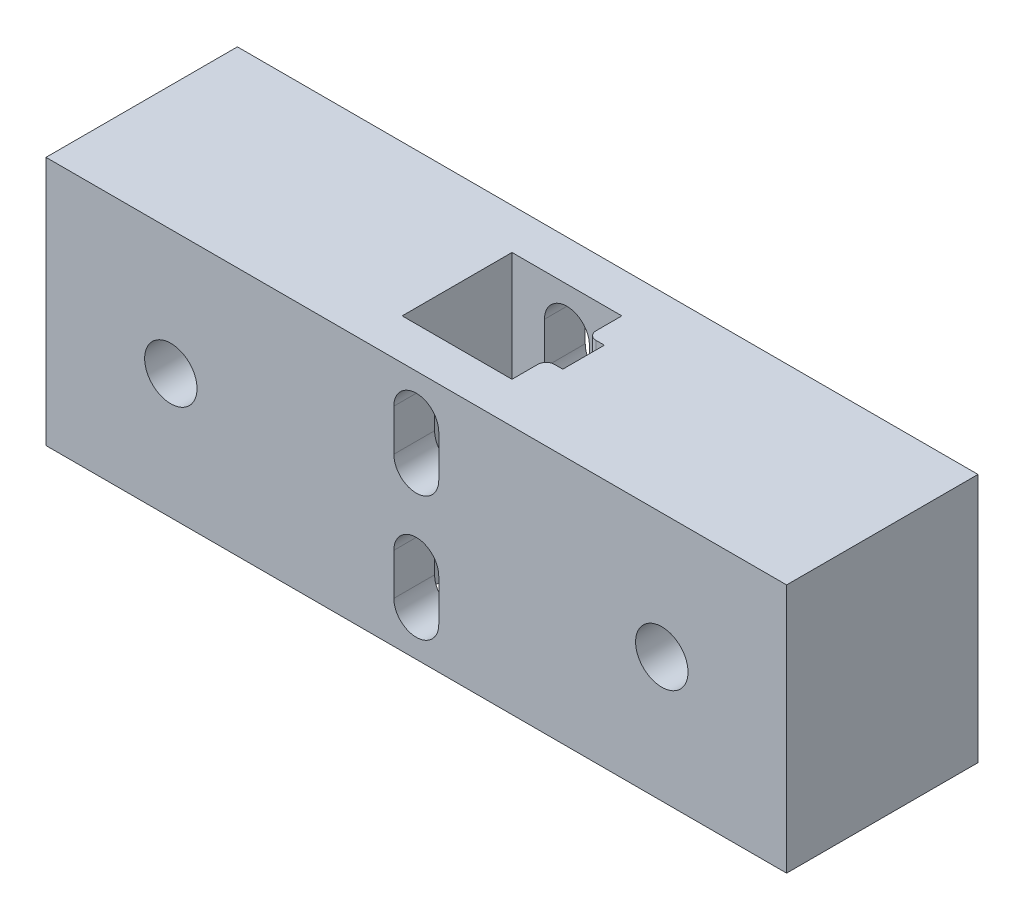
ISO-10303-21;
HEADER;
FILE_DESCRIPTION(('STEP AP214'),'2;1');
FILE_NAME('part.step','',(''),(''),'','','');
FILE_SCHEMA(('AUTOMOTIVE_DESIGN { 1 0 10303 214 1 1 1 1 }'));
ENDSEC;
DATA;
#1=APPLICATION_CONTEXT('core data for automotive mechanical design processes');
#2=APPLICATION_PROTOCOL_DEFINITION('international standard','automotive_design',2000,#1);
#3=PRODUCT_CONTEXT('',#1,'mechanical');
#4=PRODUCT('Part','Part','',(#3));
#5=PRODUCT_RELATED_PRODUCT_CATEGORY('part','',(#4));
#6=PRODUCT_DEFINITION_FORMATION('','',#4);
#7=PRODUCT_DEFINITION_CONTEXT('part definition',#1,'design');
#8=PRODUCT_DEFINITION('design','',#6,#7);
#9=PRODUCT_DEFINITION_SHAPE('','',#8);
#10=(LENGTH_UNIT() NAMED_UNIT(*) SI_UNIT(.MILLI.,.METRE.));
#11=(NAMED_UNIT(*) PLANE_ANGLE_UNIT() SI_UNIT($,.RADIAN.));
#12=(NAMED_UNIT(*) SI_UNIT($,.STERADIAN.) SOLID_ANGLE_UNIT());
#13=UNCERTAINTY_MEASURE_WITH_UNIT(LENGTH_MEASURE(1.E-05),#10,'distance_accuracy_value','');
#14=(GEOMETRIC_REPRESENTATION_CONTEXT(3) GLOBAL_UNCERTAINTY_ASSIGNED_CONTEXT((#13)) GLOBAL_UNIT_ASSIGNED_CONTEXT((#10,
#11,#12)) REPRESENTATION_CONTEXT('',''));
#15=CARTESIAN_POINT('',(0.,0.,0.));
#16=DIRECTION('',(0.,0.,1.));
#17=DIRECTION('',(1.,0.,0.));
#18=AXIS2_PLACEMENT_3D('',#15,#16,#17);
#19=CARTESIAN_POINT('',(0.,0.,23.));
#20=DIRECTION('',(0.,0.,1.));
#21=DIRECTION('',(1.,0.,0.));
#22=AXIS2_PLACEMENT_3D('',#19,#20,#21);
#23=PLANE('',#22);
#24=CARTESIAN_POINT('',(40.389968792194,-23.0911366711773,23.));
#25=DIRECTION('',(0.,0.,-1.));
#26=DIRECTION('',(-1.,0.,0.));
#27=AXIS2_PLACEMENT_3D('',#24,#25,#26);
#28=CIRCLE('',#27,2.7);
#29=CARTESIAN_POINT('',(43.089968792194,-23.0911366711773,23.));
#30=VERTEX_POINT('',#29);
#31=CARTESIAN_POINT('',(37.689968792194,-23.0911366711773,23.));
#32=VERTEX_POINT('',#31);
#33=EDGE_CURVE('E325',#30,#32,#28,.T.);
#34=ORIENTED_EDGE('',*,*,#33,.T.);
#35=DIRECTION('',(0.,1.,0.));
#36=VECTOR('',#35,1.);
#37=CARTESIAN_POINT('',(37.689968792194,-23.0911366711773,23.));
#38=LINE('',#37,#36);
#39=CARTESIAN_POINT('',(37.689968792194,-18.0911366711773,23.));
#40=VERTEX_POINT('',#39);
#41=EDGE_CURVE('E341',#32,#40,#38,.T.);
#42=ORIENTED_EDGE('',*,*,#41,.T.);
#43=CARTESIAN_POINT('',(40.389968792194,-18.0911366711773,23.));
#44=DIRECTION('',(0.,0.,-1.));
#45=DIRECTION('',(-1.,0.,0.));
#46=AXIS2_PLACEMENT_3D('',#43,#44,#45);
#47=CIRCLE('',#46,2.7);
#48=CARTESIAN_POINT('',(43.089968792194,-18.0911366711773,23.));
#49=VERTEX_POINT('',#48);
#50=EDGE_CURVE('E337',#40,#49,#47,.T.);
#51=ORIENTED_EDGE('',*,*,#50,.T.);
#52=DIRECTION('',(0.,1.,0.));
#53=VECTOR('',#52,1.);
#54=CARTESIAN_POINT('',(43.089968792194,-23.0911366711773,23.));
#55=LINE('',#54,#53);
#56=EDGE_CURVE('E303',#30,#49,#55,.T.);
#57=ORIENTED_EDGE('',*,*,#56,.F.);
#58=EDGE_LOOP('',(#34,#42,#51,#57));
#59=FACE_BOUND('',#58,.T.);
#60=CARTESIAN_POINT('',(69.8899687921941,-13.0911366711772,23.));
#61=DIRECTION('',(0.,0.,1.));
#62=DIRECTION('',(1.,0.,0.));
#63=AXIS2_PLACEMENT_3D('',#60,#61,#62);
#64=CIRCLE('',#63,3.15);
#65=CARTESIAN_POINT('',(73.0399687921941,-13.0911366711772,23.));
#66=VERTEX_POINT('',#65);
#67=EDGE_CURVE('E376',#66,#66,#64,.T.);
#68=ORIENTED_EDGE('',*,*,#67,.F.);
#69=EDGE_LOOP('',(#68));
#70=FACE_BOUND('',#69,.T.);
#71=DIRECTION('',(0.,-1.,0.));
#72=VECTOR('',#71,1.);
#73=CARTESIAN_POINT('',(-4.11003120780596,1.90886332882273,23.));
#74=LINE('',#73,#72);
#75=CARTESIAN_POINT('',(-4.11003120780596,1.90886332882273,23.));
#76=VERTEX_POINT('',#75);
#77=CARTESIAN_POINT('',(-4.11003120780596,-28.0911366711773,23.));
#78=VERTEX_POINT('',#77);
#79=EDGE_CURVE('E466',#76,#78,#74,.T.);
#80=ORIENTED_EDGE('',*,*,#79,.T.);
#81=DIRECTION('',(1.,0.,0.));
#82=VECTOR('',#81,1.);
#83=CARTESIAN_POINT('',(-4.11003120780596,-28.0911366711773,23.));
#84=LINE('',#83,#82);
#85=CARTESIAN_POINT('',(84.889968792194,-28.0911366711773,23.));
#86=VERTEX_POINT('',#85);
#87=EDGE_CURVE('E470',#78,#86,#84,.T.);
#88=ORIENTED_EDGE('',*,*,#87,.T.);
#89=DIRECTION('',(0.,1.,0.));
#90=VECTOR('',#89,1.);
#91=CARTESIAN_POINT('',(84.889968792194,1.90886332882273,23.));
#92=LINE('',#91,#90);
#93=CARTESIAN_POINT('',(84.889968792194,1.90886332882273,23.));
#94=VERTEX_POINT('',#93);
#95=EDGE_CURVE('E474',#86,#94,#92,.T.);
#96=ORIENTED_EDGE('',*,*,#95,.T.);
#97=DIRECTION('',(-1.,0.,0.));
#98=VECTOR('',#97,1.);
#99=CARTESIAN_POINT('',(-4.11003120780596,1.90886332882273,23.));
#100=LINE('',#99,#98);
#101=EDGE_CURVE('E477',#94,#76,#100,.T.);
#102=ORIENTED_EDGE('',*,*,#101,.T.);
#103=EDGE_LOOP('',(#80,#88,#96,#102));
#104=FACE_BOUND('',#103,.T.);
#105=CARTESIAN_POINT('',(10.889968792194,-13.0911366711773,23.));
#106=DIRECTION('',(0.,0.,-1.));
#107=DIRECTION('',(-1.,0.,0.));
#108=AXIS2_PLACEMENT_3D('',#105,#106,#107);
#109=CIRCLE('',#108,3.15);
#110=CARTESIAN_POINT('',(7.73996879219403,-13.0911366711773,23.));
#111=VERTEX_POINT('',#110);
#112=EDGE_CURVE('E377',#111,#111,#109,.T.);
#113=ORIENTED_EDGE('',*,*,#112,.T.);
#114=EDGE_LOOP('',(#113));
#115=FACE_BOUND('',#114,.T.);
#116=DIRECTION('',(0.,-1.,0.));
#117=VECTOR('',#116,1.);
#118=CARTESIAN_POINT('',(43.089968792194,0.,23.));
#119=LINE('',#118,#117);
#120=CARTESIAN_POINT('',(43.089968792194,-3.09113667117727,23.));
#121=VERTEX_POINT('',#120);
#122=CARTESIAN_POINT('',(43.089968792194,-8.09113667117727,23.));
#123=VERTEX_POINT('',#122);
#124=EDGE_CURVE('E263',#121,#123,#119,.T.);
#125=ORIENTED_EDGE('',*,*,#124,.T.);
#126=CARTESIAN_POINT('',(40.389968792194,-8.09113667117727,23.));
#127=DIRECTION('',(0.,0.,-1.));
#128=DIRECTION('',(-1.,0.,0.));
#129=AXIS2_PLACEMENT_3D('',#126,#127,#128);
#130=CIRCLE('',#129,2.7);
#131=CARTESIAN_POINT('',(37.6899687921941,-8.09113667117727,23.));
#132=VERTEX_POINT('',#131);
#133=EDGE_CURVE('E248',#132,#123,#130,.F.);
#134=ORIENTED_EDGE('',*,*,#133,.F.);
#135=DIRECTION('',(0.,-1.,0.));
#136=VECTOR('',#135,1.);
#137=CARTESIAN_POINT('',(37.6899687921941,0.,23.));
#138=LINE('',#137,#136);
#139=CARTESIAN_POINT('',(37.6899687921941,-3.09113667117727,23.));
#140=VERTEX_POINT('',#139);
#141=EDGE_CURVE('E235',#140,#132,#138,.T.);
#142=ORIENTED_EDGE('',*,*,#141,.F.);
#143=CARTESIAN_POINT('',(40.389968792194,-3.09113667117727,23.));
#144=DIRECTION('',(0.,0.,-1.));
#145=DIRECTION('',(-1.,0.,0.));
#146=AXIS2_PLACEMENT_3D('',#143,#144,#145);
#147=CIRCLE('',#146,2.7);
#148=EDGE_CURVE('E247',#121,#140,#147,.F.);
#149=ORIENTED_EDGE('',*,*,#148,.F.);
#150=EDGE_LOOP('',(#125,#134,#142,#149));
#151=FACE_BOUND('',#150,.T.);
#152=ADVANCED_FACE('F39',(#59,#70,#104,#115,#151),#23,.T.);
#153=CARTESIAN_POINT('',(0.,0.,0.));
#154=DIRECTION('',(0.,0.,1.));
#155=DIRECTION('',(1.,0.,0.));
#156=AXIS2_PLACEMENT_3D('',#153,#154,#155);
#157=PLANE('',#156);
#158=CARTESIAN_POINT('',(10.889968792194,-13.0911366711773,0.));
#159=DIRECTION('',(0.,0.,-1.));
#160=DIRECTION('',(-1.,0.,0.));
#161=AXIS2_PLACEMENT_3D('',#158,#159,#160);
#162=CIRCLE('',#161,3.15);
#163=CARTESIAN_POINT('',(7.73996879219403,-13.0911366711773,0.));
#164=VERTEX_POINT('',#163);
#165=EDGE_CURVE('E382',#164,#164,#162,.T.);
#166=ORIENTED_EDGE('',*,*,#165,.F.);
#167=EDGE_LOOP('',(#166));
#168=FACE_BOUND('',#167,.T.);
#169=CARTESIAN_POINT('',(69.8899687921941,-13.0911366711772,0.));
#170=DIRECTION('',(0.,0.,1.));
#171=DIRECTION('',(1.,0.,0.));
#172=AXIS2_PLACEMENT_3D('',#169,#170,#171);
#173=CIRCLE('',#172,3.15);
#174=CARTESIAN_POINT('',(73.0399687921941,-13.0911366711772,0.));
#175=VERTEX_POINT('',#174);
#176=EDGE_CURVE('E386',#175,#175,#173,.T.);
#177=ORIENTED_EDGE('',*,*,#176,.T.);
#178=EDGE_LOOP('',(#177));
#179=FACE_BOUND('',#178,.T.);
#180=DIRECTION('',(0.,-1.,0.));
#181=VECTOR('',#180,1.);
#182=CARTESIAN_POINT('',(-4.11003120780596,1.90886332882273,0.));
#183=LINE('',#182,#181);
#184=CARTESIAN_POINT('',(-4.11003120780596,1.90886332882273,0.));
#185=VERTEX_POINT('',#184);
#186=CARTESIAN_POINT('',(-4.11003120780596,-28.0911366711773,0.));
#187=VERTEX_POINT('',#186);
#188=EDGE_CURVE('E446',#185,#187,#183,.T.);
#189=ORIENTED_EDGE('',*,*,#188,.F.);
#190=DIRECTION('',(-1.,0.,0.));
#191=VECTOR('',#190,1.);
#192=CARTESIAN_POINT('',(-4.11003120780596,1.90886332882273,0.));
#193=LINE('',#192,#191);
#194=CARTESIAN_POINT('',(84.889968792194,1.90886332882273,0.));
#195=VERTEX_POINT('',#194);
#196=EDGE_CURVE('E471',#195,#185,#193,.T.);
#197=ORIENTED_EDGE('',*,*,#196,.F.);
#198=DIRECTION('',(0.,1.,0.));
#199=VECTOR('',#198,1.);
#200=CARTESIAN_POINT('',(84.889968792194,1.90886332882273,0.));
#201=LINE('',#200,#199);
#202=CARTESIAN_POINT('',(84.889968792194,-28.0911366711773,0.));
#203=VERTEX_POINT('',#202);
#204=EDGE_CURVE('E487',#203,#195,#201,.T.);
#205=ORIENTED_EDGE('',*,*,#204,.F.);
#206=DIRECTION('',(1.,0.,0.));
#207=VECTOR('',#206,1.);
#208=CARTESIAN_POINT('',(-4.11003120780596,-28.0911366711773,0.));
#209=LINE('',#208,#207);
#210=EDGE_CURVE('E484',#187,#203,#209,.T.);
#211=ORIENTED_EDGE('',*,*,#210,.F.);
#212=EDGE_LOOP('',(#189,#197,#205,#211));
#213=FACE_BOUND('',#212,.T.);
#214=DIRECTION('',(0.,1.,0.));
#215=VECTOR('',#214,1.);
#216=CARTESIAN_POINT('',(37.689968792194,-23.0911366711773,0.));
#217=LINE('',#216,#215);
#218=CARTESIAN_POINT('',(37.689968792194,-23.0911366711773,0.));
#219=VERTEX_POINT('',#218);
#220=CARTESIAN_POINT('',(37.689968792194,-18.0911366711773,0.));
#221=VERTEX_POINT('',#220);
#222=EDGE_CURVE('E329',#219,#221,#217,.T.);
#223=ORIENTED_EDGE('',*,*,#222,.F.);
#224=CARTESIAN_POINT('',(40.389968792194,-23.0911366711773,0.));
#225=DIRECTION('',(0.,0.,-1.));
#226=DIRECTION('',(-1.,0.,0.));
#227=AXIS2_PLACEMENT_3D('',#224,#225,#226);
#228=CIRCLE('',#227,2.7);
#229=CARTESIAN_POINT('',(43.089968792194,-23.0911366711773,0.));
#230=VERTEX_POINT('',#229);
#231=EDGE_CURVE('E281',#230,#219,#228,.T.);
#232=ORIENTED_EDGE('',*,*,#231,.F.);
#233=DIRECTION('',(0.,1.,0.));
#234=VECTOR('',#233,1.);
#235=CARTESIAN_POINT('',(43.089968792194,-23.0911366711773,0.));
#236=LINE('',#235,#234);
#237=CARTESIAN_POINT('',(43.089968792194,-18.0911366711773,0.));
#238=VERTEX_POINT('',#237);
#239=EDGE_CURVE('E320',#230,#238,#236,.T.);
#240=ORIENTED_EDGE('',*,*,#239,.T.);
#241=CARTESIAN_POINT('',(40.389968792194,-18.0911366711773,0.));
#242=DIRECTION('',(0.,0.,-1.));
#243=DIRECTION('',(-1.,0.,0.));
#244=AXIS2_PLACEMENT_3D('',#241,#242,#243);
#245=CIRCLE('',#244,2.7);
#246=EDGE_CURVE('E324',#221,#238,#245,.T.);
#247=ORIENTED_EDGE('',*,*,#246,.F.);
#248=EDGE_LOOP('',(#223,#232,#240,#247));
#249=FACE_BOUND('',#248,.T.);
#250=CARTESIAN_POINT('',(40.389968792194,-8.09113667117727,0.));
#251=DIRECTION('',(0.,0.,-1.));
#252=DIRECTION('',(-1.,0.,0.));
#253=AXIS2_PLACEMENT_3D('',#250,#251,#252);
#254=CIRCLE('',#253,2.7);
#255=CARTESIAN_POINT('',(37.6899687921941,-8.09113667117727,0.));
#256=VERTEX_POINT('',#255);
#257=CARTESIAN_POINT('',(43.089968792194,-8.09113667117727,0.));
#258=VERTEX_POINT('',#257);
#259=EDGE_CURVE('E276',#256,#258,#254,.F.);
#260=ORIENTED_EDGE('',*,*,#259,.T.);
#261=DIRECTION('',(0.,-1.,0.));
#262=VECTOR('',#261,1.);
#263=CARTESIAN_POINT('',(43.089968792194,0.,0.));
#264=LINE('',#263,#262);
#265=CARTESIAN_POINT('',(43.089968792194,-3.09113667117727,0.));
#266=VERTEX_POINT('',#265);
#267=EDGE_CURVE('E265',#266,#258,#264,.T.);
#268=ORIENTED_EDGE('',*,*,#267,.F.);
#269=CARTESIAN_POINT('',(40.389968792194,-3.09113667117727,0.));
#270=DIRECTION('',(0.,0.,-1.));
#271=DIRECTION('',(-1.,0.,0.));
#272=AXIS2_PLACEMENT_3D('',#269,#270,#271);
#273=CIRCLE('',#272,2.7);
#274=CARTESIAN_POINT('',(37.6899687921941,-3.09113667117727,0.));
#275=VERTEX_POINT('',#274);
#276=EDGE_CURVE('E269',#266,#275,#273,.F.);
#277=ORIENTED_EDGE('',*,*,#276,.T.);
#278=DIRECTION('',(0.,-1.,0.));
#279=VECTOR('',#278,1.);
#280=CARTESIAN_POINT('',(37.6899687921941,0.,0.));
#281=LINE('',#280,#279);
#282=EDGE_CURVE('E280',#275,#256,#281,.T.);
#283=ORIENTED_EDGE('',*,*,#282,.T.);
#284=EDGE_LOOP('',(#260,#268,#277,#283));
#285=FACE_BOUND('',#284,.T.);
#286=ADVANCED_FACE('F598',(#168,#179,#213,#249,#285),#157,.F.);
#287=CARTESIAN_POINT('',(0.,-28.0911366711773,4.89999999999999));
#288=DIRECTION('',(0.,0.,-1.));
#289=DIRECTION('',(-1.,0.,0.));
#290=AXIS2_PLACEMENT_3D('',#287,#288,#289);
#291=PLANE('',#290);
#292=DIRECTION('',(-1.,0.,0.));
#293=VECTOR('',#292,1.);
#294=CARTESIAN_POINT('',(0.,1.90886332882273,4.89999999999999));
#295=LINE('',#294,#293);
#296=CARTESIAN_POINT('',(46.989968792194,1.90886332882273,4.89999999999999));
#297=VERTEX_POINT('',#296);
#298=CARTESIAN_POINT('',(33.789968792194,1.90886332882273,4.89999999999999));
#299=VERTEX_POINT('',#298);
#300=EDGE_CURVE('E381',#297,#299,#295,.T.);
#301=ORIENTED_EDGE('',*,*,#300,.T.);
#302=DIRECTION('',(0.,1.,0.));
#303=VECTOR('',#302,1.);
#304=CARTESIAN_POINT('',(33.789968792194,-28.0911366711773,4.89999999999999));
#305=LINE('',#304,#303);
#306=CARTESIAN_POINT('',(33.789968792194,-28.0911366711773,4.89999999999999));
#307=VERTEX_POINT('',#306);
#308=EDGE_CURVE('E462',#307,#299,#305,.T.);
#309=ORIENTED_EDGE('',*,*,#308,.F.);
#310=DIRECTION('',(-1.,0.,0.));
#311=VECTOR('',#310,1.);
#312=CARTESIAN_POINT('',(0.,-28.0911366711773,4.89999999999999));
#313=LINE('',#312,#311);
#314=CARTESIAN_POINT('',(46.989968792194,-28.0911366711773,4.89999999999999));
#315=VERTEX_POINT('',#314);
#316=EDGE_CURVE('E393',#315,#307,#313,.T.);
#317=ORIENTED_EDGE('',*,*,#316,.F.);
#318=DIRECTION('',(0.,1.,0.));
#319=VECTOR('',#318,1.);
#320=CARTESIAN_POINT('',(46.989968792194,-28.0911366711773,4.89999999999999));
#321=LINE('',#320,#319);
#322=EDGE_CURVE('E443',#315,#297,#321,.T.);
#323=ORIENTED_EDGE('',*,*,#322,.T.);
#324=EDGE_LOOP('',(#301,#309,#317,#323));
#325=FACE_BOUND('',#324,.T.);
#326=DIRECTION('',(0.,1.,0.));
#327=VECTOR('',#326,1.);
#328=CARTESIAN_POINT('',(43.089968792194,-28.0911366711773,4.89999999999999));
#329=LINE('',#328,#327);
#330=CARTESIAN_POINT('',(43.089968792194,-23.0911366711773,4.89999999999999));
#331=VERTEX_POINT('',#330);
#332=CARTESIAN_POINT('',(43.089968792194,-18.0911366711773,4.89999999999999));
#333=VERTEX_POINT('',#332);
#334=EDGE_CURVE('E355',#331,#333,#329,.T.);
#335=ORIENTED_EDGE('',*,*,#334,.F.);
#336=CARTESIAN_POINT('',(40.389968792194,-23.0911366711773,4.89999999999999));
#337=DIRECTION('',(0.,0.,-1.));
#338=DIRECTION('',(-1.,0.,0.));
#339=AXIS2_PLACEMENT_3D('',#336,#337,#338);
#340=CIRCLE('',#339,2.7);
#341=CARTESIAN_POINT('',(37.689968792194,-23.0911366711773,4.89999999999999));
#342=VERTEX_POINT('',#341);
#343=EDGE_CURVE('E358',#331,#342,#340,.T.);
#344=ORIENTED_EDGE('',*,*,#343,.T.);
#345=DIRECTION('',(0.,1.,0.));
#346=VECTOR('',#345,1.);
#347=CARTESIAN_POINT('',(37.689968792194,-28.0911366711773,4.89999999999999));
#348=LINE('',#347,#346);
#349=CARTESIAN_POINT('',(37.689968792194,-18.0911366711773,4.89999999999999));
#350=VERTEX_POINT('',#349);
#351=EDGE_CURVE('E291',#342,#350,#348,.T.);
#352=ORIENTED_EDGE('',*,*,#351,.T.);
#353=CARTESIAN_POINT('',(40.389968792194,-18.0911366711773,4.89999999999999));
#354=DIRECTION('',(0.,0.,-1.));
#355=DIRECTION('',(-1.,0.,0.));
#356=AXIS2_PLACEMENT_3D('',#353,#354,#355);
#357=CIRCLE('',#356,2.7);
#358=EDGE_CURVE('E351',#350,#333,#357,.T.);
#359=ORIENTED_EDGE('',*,*,#358,.T.);
#360=EDGE_LOOP('',(#335,#344,#352,#359));
#361=FACE_BOUND('',#360,.T.);
#362=CARTESIAN_POINT('',(40.389968792194,-8.09113667117727,4.89999999999999));
#363=DIRECTION('',(0.,0.,-1.));
#364=DIRECTION('',(-1.,0.,0.));
#365=AXIS2_PLACEMENT_3D('',#362,#363,#364);
#366=CIRCLE('',#365,2.7);
#367=CARTESIAN_POINT('',(37.6899687921941,-8.09113667117727,4.89999999999999));
#368=VERTEX_POINT('',#367);
#369=CARTESIAN_POINT('',(43.089968792194,-8.09113667117727,4.89999999999999));
#370=VERTEX_POINT('',#369);
#371=EDGE_CURVE('E373',#368,#370,#366,.F.);
#372=ORIENTED_EDGE('',*,*,#371,.F.);
#373=DIRECTION('',(0.,-1.,0.));
#374=VECTOR('',#373,1.);
#375=CARTESIAN_POINT('',(37.6899687921941,-28.0911366711773,4.89999999999999));
#376=LINE('',#375,#374);
#377=CARTESIAN_POINT('',(37.6899687921941,-3.09113667117727,4.89999999999999));
#378=VERTEX_POINT('',#377);
#379=EDGE_CURVE('E362',#378,#368,#376,.T.);
#380=ORIENTED_EDGE('',*,*,#379,.F.);
#381=CARTESIAN_POINT('',(40.389968792194,-3.09113667117727,4.89999999999999));
#382=DIRECTION('',(0.,0.,-1.));
#383=DIRECTION('',(-1.,0.,0.));
#384=AXIS2_PLACEMENT_3D('',#381,#382,#383);
#385=CIRCLE('',#384,2.7);
#386=CARTESIAN_POINT('',(43.089968792194,-3.09113667117727,4.89999999999999));
#387=VERTEX_POINT('',#386);
#388=EDGE_CURVE('E365',#387,#378,#385,.F.);
#389=ORIENTED_EDGE('',*,*,#388,.F.);
#390=DIRECTION('',(0.,-1.,0.));
#391=VECTOR('',#390,1.);
#392=CARTESIAN_POINT('',(43.089968792194,-28.0911366711773,4.89999999999999));
#393=LINE('',#392,#391);
#394=EDGE_CURVE('E369',#387,#370,#393,.T.);
#395=ORIENTED_EDGE('',*,*,#394,.T.);
#396=EDGE_LOOP('',(#372,#380,#389,#395));
#397=FACE_BOUND('',#396,.T.);
#398=ADVANCED_FACE('F606',(#325,#361,#397),#291,.F.);
#399=CARTESIAN_POINT('',(0.,-28.0911366711773,18.1));
#400=DIRECTION('',(0.,0.,-1.));
#401=DIRECTION('',(-1.,0.,0.));
#402=AXIS2_PLACEMENT_3D('',#399,#400,#401);
#403=PLANE('',#402);
#404=CARTESIAN_POINT('',(40.389968792194,-23.0911366711773,18.1));
#405=DIRECTION('',(0.,0.,-1.));
#406=DIRECTION('',(-1.,0.,0.));
#407=AXIS2_PLACEMENT_3D('',#404,#405,#406);
#408=CIRCLE('',#407,2.7);
#409=CARTESIAN_POINT('',(43.089968792194,-23.0911366711773,18.1));
#410=VERTEX_POINT('',#409);
#411=CARTESIAN_POINT('',(37.689968792194,-23.0911366711773,18.1));
#412=VERTEX_POINT('',#411);
#413=EDGE_CURVE('E517',#410,#412,#408,.T.);
#414=ORIENTED_EDGE('',*,*,#413,.F.);
#415=DIRECTION('',(0.,1.,0.));
#416=VECTOR('',#415,1.);
#417=CARTESIAN_POINT('',(43.089968792194,-28.0911366711773,18.1));
#418=LINE('',#417,#416);
#419=CARTESIAN_POINT('',(43.089968792194,-18.0911366711773,18.1));
#420=VERTEX_POINT('',#419);
#421=EDGE_CURVE('E513',#410,#420,#418,.T.);
#422=ORIENTED_EDGE('',*,*,#421,.T.);
#423=CARTESIAN_POINT('',(40.389968792194,-18.0911366711773,18.1));
#424=DIRECTION('',(0.,0.,-1.));
#425=DIRECTION('',(-1.,0.,0.));
#426=AXIS2_PLACEMENT_3D('',#423,#424,#425);
#427=CIRCLE('',#426,2.7);
#428=CARTESIAN_POINT('',(37.689968792194,-18.0911366711773,18.1));
#429=VERTEX_POINT('',#428);
#430=EDGE_CURVE('E510',#429,#420,#427,.T.);
#431=ORIENTED_EDGE('',*,*,#430,.F.);
#432=DIRECTION('',(0.,1.,0.));
#433=VECTOR('',#432,1.);
#434=CARTESIAN_POINT('',(37.689968792194,-28.0911366711773,18.1));
#435=LINE('',#434,#433);
#436=EDGE_CURVE('E507',#412,#429,#435,.T.);
#437=ORIENTED_EDGE('',*,*,#436,.F.);
#438=EDGE_LOOP('',(#414,#422,#431,#437));
#439=FACE_BOUND('',#438,.T.);
#440=DIRECTION('',(-1.,0.,0.));
#441=VECTOR('',#440,1.);
#442=CARTESIAN_POINT('',(0.,1.90886332882273,18.1));
#443=LINE('',#442,#441);
#444=CARTESIAN_POINT('',(46.989968792194,1.90886332882273,18.1));
#445=VERTEX_POINT('',#444);
#446=CARTESIAN_POINT('',(33.789968792194,1.90886332882273,18.1));
#447=VERTEX_POINT('',#446);
#448=EDGE_CURVE('E426',#445,#447,#443,.T.);
#449=ORIENTED_EDGE('',*,*,#448,.F.);
#450=DIRECTION('',(0.,1.,0.));
#451=VECTOR('',#450,1.);
#452=CARTESIAN_POINT('',(46.989968792194,-28.0911366711773,18.1));
#453=LINE('',#452,#451);
#454=CARTESIAN_POINT('',(46.989968792194,-28.0911366711773,18.1));
#455=VERTEX_POINT('',#454);
#456=EDGE_CURVE('E455',#455,#445,#453,.T.);
#457=ORIENTED_EDGE('',*,*,#456,.F.);
#458=DIRECTION('',(-1.,0.,0.));
#459=VECTOR('',#458,1.);
#460=CARTESIAN_POINT('',(0.,-28.0911366711773,18.1));
#461=LINE('',#460,#459);
#462=CARTESIAN_POINT('',(33.789968792194,-28.0911366711773,18.1));
#463=VERTEX_POINT('',#462);
#464=EDGE_CURVE('E402',#455,#463,#461,.T.);
#465=ORIENTED_EDGE('',*,*,#464,.T.);
#466=DIRECTION('',(0.,1.,0.));
#467=VECTOR('',#466,1.);
#468=CARTESIAN_POINT('',(33.789968792194,-28.0911366711773,18.1));
#469=LINE('',#468,#467);
#470=EDGE_CURVE('E459',#463,#447,#469,.T.);
#471=ORIENTED_EDGE('',*,*,#470,.T.);
#472=EDGE_LOOP('',(#449,#457,#465,#471));
#473=FACE_BOUND('',#472,.T.);
#474=DIRECTION('',(0.,-1.,0.));
#475=VECTOR('',#474,1.);
#476=CARTESIAN_POINT('',(37.6899687921941,-28.0911366711773,18.1));
#477=LINE('',#476,#475);
#478=CARTESIAN_POINT('',(37.6899687921941,-3.09113667117727,18.1));
#479=VERTEX_POINT('',#478);
#480=CARTESIAN_POINT('',(37.6899687921941,-8.09113667117727,18.1));
#481=VERTEX_POINT('',#480);
#482=EDGE_CURVE('E521',#479,#481,#477,.T.);
#483=ORIENTED_EDGE('',*,*,#482,.T.);
#484=CARTESIAN_POINT('',(40.389968792194,-8.09113667117727,18.1));
#485=DIRECTION('',(0.,0.,-1.));
#486=DIRECTION('',(-1.,0.,0.));
#487=AXIS2_PLACEMENT_3D('',#484,#485,#486);
#488=CIRCLE('',#487,2.7);
#489=CARTESIAN_POINT('',(43.089968792194,-8.09113667117727,18.1));
#490=VERTEX_POINT('',#489);
#491=EDGE_CURVE('E255',#481,#490,#488,.F.);
#492=ORIENTED_EDGE('',*,*,#491,.T.);
#493=DIRECTION('',(0.,-1.,0.));
#494=VECTOR('',#493,1.);
#495=CARTESIAN_POINT('',(43.089968792194,-28.0911366711773,18.1));
#496=LINE('',#495,#494);
#497=CARTESIAN_POINT('',(43.089968792194,-3.09113667117727,18.1));
#498=VERTEX_POINT('',#497);
#499=EDGE_CURVE('E528',#498,#490,#496,.T.);
#500=ORIENTED_EDGE('',*,*,#499,.F.);
#501=CARTESIAN_POINT('',(40.389968792194,-3.09113667117727,18.1));
#502=DIRECTION('',(0.,0.,-1.));
#503=DIRECTION('',(-1.,0.,0.));
#504=AXIS2_PLACEMENT_3D('',#501,#502,#503);
#505=CIRCLE('',#504,2.7);
#506=EDGE_CURVE('E524',#498,#479,#505,.F.);
#507=ORIENTED_EDGE('',*,*,#506,.T.);
#508=EDGE_LOOP('',(#483,#492,#500,#507));
#509=FACE_BOUND('',#508,.T.);
#510=ADVANCED_FACE('F646',(#439,#473,#509),#403,.T.);
#511=CARTESIAN_POINT('',(-4.11003120780596,1.90886332882273,23.));
#512=DIRECTION('',(1.,0.,0.));
#513=DIRECTION('',(0.,1.,0.));
#514=AXIS2_PLACEMENT_3D('',#511,#512,#513);
#515=PLANE('',#514);
#516=ORIENTED_EDGE('',*,*,#188,.T.);
#517=DIRECTION('',(0.,0.,-1.));
#518=VECTOR('',#517,1.);
#519=CARTESIAN_POINT('',(-4.11003120780596,-28.0911366711773,23.));
#520=LINE('',#519,#518);
#521=EDGE_CURVE('E503',#78,#187,#520,.T.);
#522=ORIENTED_EDGE('',*,*,#521,.F.);
#523=ORIENTED_EDGE('',*,*,#79,.F.);
#524=DIRECTION('',(0.,0.,-1.));
#525=VECTOR('',#524,1.);
#526=CARTESIAN_POINT('',(-4.11003120780596,1.90886332882273,23.));
#527=LINE('',#526,#525);
#528=EDGE_CURVE('E480',#76,#185,#527,.T.);
#529=ORIENTED_EDGE('',*,*,#528,.T.);
#530=EDGE_LOOP('',(#516,#522,#523,#529));
#531=FACE_BOUND('',#530,.T.);
#532=ADVANCED_FACE('F644',(#531),#515,.F.);
#533=CARTESIAN_POINT('',(-4.11003120780596,-28.0911366711773,23.));
#534=DIRECTION('',(0.,1.,0.));
#535=DIRECTION('',(0.,0.,1.));
#536=AXIS2_PLACEMENT_3D('',#533,#534,#535);
#537=PLANE('',#536);
#538=DIRECTION('',(1.,0.,0.));
#539=VECTOR('',#538,1.);
#540=CARTESIAN_POINT('',(0.,-28.0911366711773,8.99999999999999));
#541=LINE('',#540,#539);
#542=CARTESIAN_POINT('',(47.989968792194,-28.0911366711773,8.99999999999999));
#543=VERTEX_POINT('',#542);
#544=CARTESIAN_POINT('',(48.989968792194,-28.0911366711773,8.99999999999999));
#545=VERTEX_POINT('',#544);
#546=EDGE_CURVE('E417',#543,#545,#541,.T.);
#547=ORIENTED_EDGE('',*,*,#546,.F.);
#548=CARTESIAN_POINT('',(47.989968792194,-28.0911366711773,7.99999999999999));
#549=DIRECTION('',(0.,1.,0.));
#550=DIRECTION('',(0.,0.,1.));
#551=AXIS2_PLACEMENT_3D('',#548,#549,#550);
#552=CIRCLE('',#551,1.);
#553=CARTESIAN_POINT('',(46.989968792194,-28.0911366711773,7.99999999999999));
#554=VERTEX_POINT('',#553);
#555=EDGE_CURVE('E548',#543,#554,#552,.F.);
#556=ORIENTED_EDGE('',*,*,#555,.T.);
#557=DIRECTION('',(0.,0.,1.));
#558=VECTOR('',#557,1.);
#559=CARTESIAN_POINT('',(46.989968792194,-28.0911366711773,0.));
#560=LINE('',#559,#558);
#561=EDGE_CURVE('E410',#315,#554,#560,.T.);
#562=ORIENTED_EDGE('',*,*,#561,.F.);
#563=ORIENTED_EDGE('',*,*,#316,.T.);
#564=DIRECTION('',(0.,0.,1.));
#565=VECTOR('',#564,1.);
#566=CARTESIAN_POINT('',(33.789968792194,-28.0911366711773,0.));
#567=LINE('',#566,#565);
#568=EDGE_CURVE('E397',#307,#463,#567,.T.);
#569=ORIENTED_EDGE('',*,*,#568,.T.);
#570=ORIENTED_EDGE('',*,*,#464,.F.);
#571=CARTESIAN_POINT('',(46.989968792194,-28.0911366711773,15.));
#572=VERTEX_POINT('',#571);
#573=EDGE_CURVE('E406',#572,#455,#560,.T.);
#574=ORIENTED_EDGE('',*,*,#573,.F.);
#575=CARTESIAN_POINT('',(47.989968792194,-28.0911366711773,15.));
#576=DIRECTION('',(0.,1.,0.));
#577=DIRECTION('',(0.,0.,1.));
#578=AXIS2_PLACEMENT_3D('',#575,#576,#577);
#579=CIRCLE('',#578,1.);
#580=CARTESIAN_POINT('',(47.989968792194,-28.0911366711773,14.));
#581=VERTEX_POINT('',#580);
#582=EDGE_CURVE('E55',#572,#581,#579,.F.);
#583=ORIENTED_EDGE('',*,*,#582,.T.);
#584=DIRECTION('',(1.,0.,0.));
#585=VECTOR('',#584,1.);
#586=CARTESIAN_POINT('',(0.,-28.0911366711773,13.9999999999999));
#587=LINE('',#586,#585);
#588=CARTESIAN_POINT('',(48.989968792194,-28.0911366711773,14.));
#589=VERTEX_POINT('',#588);
#590=EDGE_CURVE('E409',#581,#589,#587,.T.);
#591=ORIENTED_EDGE('',*,*,#590,.T.);
#592=DIRECTION('',(0.,0.,-1.));
#593=VECTOR('',#592,1.);
#594=CARTESIAN_POINT('',(48.989968792194,-28.0911366711773,0.));
#595=LINE('',#594,#593);
#596=EDGE_CURVE('E413',#589,#545,#595,.T.);
#597=ORIENTED_EDGE('',*,*,#596,.T.);
#598=EDGE_LOOP('',(#547,#556,#562,#563,#569,#570,#574,#583,#591,#597));
#599=FACE_BOUND('',#598,.T.);
#600=ORIENTED_EDGE('',*,*,#210,.T.);
#601=DIRECTION('',(0.,0.,-1.));
#602=VECTOR('',#601,1.);
#603=CARTESIAN_POINT('',(84.889968792194,-28.0911366711773,23.));
#604=LINE('',#603,#602);
#605=EDGE_CURVE('E499',#86,#203,#604,.T.);
#606=ORIENTED_EDGE('',*,*,#605,.F.);
#607=ORIENTED_EDGE('',*,*,#87,.F.);
#608=ORIENTED_EDGE('',*,*,#521,.T.);
#609=EDGE_LOOP('',(#600,#606,#607,#608));
#610=FACE_BOUND('',#609,.T.);
#611=ADVANCED_FACE('F569',(#599,#610),#537,.F.);
#612=CARTESIAN_POINT('',(84.889968792194,1.90886332882273,23.));
#613=DIRECTION('',(-1.,0.,0.));
#614=DIRECTION('',(0.,0.,1.));
#615=AXIS2_PLACEMENT_3D('',#612,#613,#614);
#616=PLANE('',#615);
#617=ORIENTED_EDGE('',*,*,#204,.T.);
#618=DIRECTION('',(0.,0.,-1.));
#619=VECTOR('',#618,1.);
#620=CARTESIAN_POINT('',(84.889968792194,1.90886332882273,23.));
#621=LINE('',#620,#619);
#622=EDGE_CURVE('E495',#94,#195,#621,.T.);
#623=ORIENTED_EDGE('',*,*,#622,.F.);
#624=ORIENTED_EDGE('',*,*,#95,.F.);
#625=ORIENTED_EDGE('',*,*,#605,.T.);
#626=EDGE_LOOP('',(#617,#623,#624,#625));
#627=FACE_BOUND('',#626,.T.);
#628=ADVANCED_FACE('F638',(#627),#616,.F.);
#629=CARTESIAN_POINT('',(-4.11003120780596,1.90886332882273,23.));
#630=DIRECTION('',(0.,-1.,0.));
#631=DIRECTION('',(0.,0.,-1.));
#632=AXIS2_PLACEMENT_3D('',#629,#630,#631);
#633=PLANE('',#632);
#634=DIRECTION('',(0.,0.,1.));
#635=VECTOR('',#634,1.);
#636=CARTESIAN_POINT('',(46.989968792194,1.90886332882273,0.));
#637=LINE('',#636,#635);
#638=CARTESIAN_POINT('',(46.989968792194,1.90886332882273,7.99999999999999));
#639=VERTEX_POINT('',#638);
#640=EDGE_CURVE('E398',#297,#639,#637,.T.);
#641=ORIENTED_EDGE('',*,*,#640,.T.);
#642=CARTESIAN_POINT('',(47.989968792194,1.90886332882273,7.99999999999999));
#643=DIRECTION('',(0.,-1.,0.));
#644=DIRECTION('',(0.,0.,-1.));
#645=AXIS2_PLACEMENT_3D('',#642,#643,#644);
#646=CIRCLE('',#645,1.);
#647=CARTESIAN_POINT('',(47.989968792194,1.90886332882273,8.99999999999999));
#648=VERTEX_POINT('',#647);
#649=EDGE_CURVE('E540',#639,#648,#646,.F.);
#650=ORIENTED_EDGE('',*,*,#649,.T.);
#651=DIRECTION('',(1.,0.,0.));
#652=VECTOR('',#651,1.);
#653=CARTESIAN_POINT('',(0.,1.90886332882273,8.99999999999999));
#654=LINE('',#653,#652);
#655=CARTESIAN_POINT('',(48.989968792194,1.90886332882273,8.99999999999999));
#656=VERTEX_POINT('',#655);
#657=EDGE_CURVE('E440',#648,#656,#654,.T.);
#658=ORIENTED_EDGE('',*,*,#657,.T.);
#659=DIRECTION('',(0.,0.,-1.));
#660=VECTOR('',#659,1.);
#661=CARTESIAN_POINT('',(48.989968792194,1.90886332882273,0.));
#662=LINE('',#661,#660);
#663=CARTESIAN_POINT('',(48.989968792194,1.90886332882273,14.));
#664=VERTEX_POINT('',#663);
#665=EDGE_CURVE('E436',#664,#656,#662,.T.);
#666=ORIENTED_EDGE('',*,*,#665,.F.);
#667=DIRECTION('',(1.,0.,0.));
#668=VECTOR('',#667,1.);
#669=CARTESIAN_POINT('',(0.,1.90886332882273,13.9999999999999));
#670=LINE('',#669,#668);
#671=CARTESIAN_POINT('',(47.989968792194,1.90886332882273,14.));
#672=VERTEX_POINT('',#671);
#673=EDGE_CURVE('E433',#672,#664,#670,.T.);
#674=ORIENTED_EDGE('',*,*,#673,.F.);
#675=CARTESIAN_POINT('',(47.989968792194,1.90886332882273,15.));
#676=DIRECTION('',(0.,-1.,0.));
#677=DIRECTION('',(0.,0.,-1.));
#678=AXIS2_PLACEMENT_3D('',#675,#676,#677);
#679=CIRCLE('',#678,1.);
#680=CARTESIAN_POINT('',(46.989968792194,1.90886332882273,15.));
#681=VERTEX_POINT('',#680);
#682=EDGE_CURVE('E537',#672,#681,#679,.F.);
#683=ORIENTED_EDGE('',*,*,#682,.T.);
#684=EDGE_CURVE('E430',#681,#445,#637,.T.);
#685=ORIENTED_EDGE('',*,*,#684,.T.);
#686=ORIENTED_EDGE('',*,*,#448,.T.);
#687=DIRECTION('',(0.,0.,1.));
#688=VECTOR('',#687,1.);
#689=CARTESIAN_POINT('',(33.789968792194,1.90886332882273,0.));
#690=LINE('',#689,#688);
#691=EDGE_CURVE('E422',#299,#447,#690,.T.);
#692=ORIENTED_EDGE('',*,*,#691,.F.);
#693=ORIENTED_EDGE('',*,*,#300,.F.);
#694=EDGE_LOOP('',(#641,#650,#658,#666,#674,#683,#685,#686,#692,#693));
#695=FACE_BOUND('',#694,.T.);
#696=ORIENTED_EDGE('',*,*,#196,.T.);
#697=ORIENTED_EDGE('',*,*,#528,.F.);
#698=ORIENTED_EDGE('',*,*,#101,.F.);
#699=ORIENTED_EDGE('',*,*,#622,.T.);
#700=EDGE_LOOP('',(#696,#697,#698,#699));
#701=FACE_BOUND('',#700,.T.);
#702=ADVANCED_FACE('F561',(#695,#701),#633,.F.);
#703=CARTESIAN_POINT('',(46.989968792194,-28.0911366711773,0.));
#704=DIRECTION('',(-1.,0.,0.));
#705=DIRECTION('',(0.,0.,1.));
#706=AXIS2_PLACEMENT_3D('',#703,#704,#705);
#707=PLANE('',#706);
#708=ORIENTED_EDGE('',*,*,#561,.T.);
#709=DIRECTION('',(0.,1.,0.));
#710=VECTOR('',#709,1.);
#711=CARTESIAN_POINT('',(46.989968792194,-28.0911366711773,7.99999999999999));
#712=LINE('',#711,#710);
#713=EDGE_CURVE('E533',#554,#639,#712,.T.);
#714=ORIENTED_EDGE('',*,*,#713,.T.);
#715=ORIENTED_EDGE('',*,*,#640,.F.);
#716=ORIENTED_EDGE('',*,*,#322,.F.);
#717=EDGE_LOOP('',(#708,#714,#715,#716));
#718=FACE_BOUND('',#717,.T.);
#719=ADVANCED_FACE('F581',(#718),#707,.T.);
#720=CARTESIAN_POINT('',(0.,-28.0911366711773,8.99999999999999));
#721=DIRECTION('',(0.,0.,1.));
#722=DIRECTION('',(1.,0.,0.));
#723=AXIS2_PLACEMENT_3D('',#720,#721,#722);
#724=PLANE('',#723);
#725=ORIENTED_EDGE('',*,*,#657,.F.);
#726=DIRECTION('',(0.,1.,0.));
#727=VECTOR('',#726,1.);
#728=CARTESIAN_POINT('',(47.989968792194,-28.0911366711773,8.99999999999999));
#729=LINE('',#728,#727);
#730=EDGE_CURVE('E543',#648,#543,#729,.F.);
#731=ORIENTED_EDGE('',*,*,#730,.T.);
#732=ORIENTED_EDGE('',*,*,#546,.T.);
#733=DIRECTION('',(0.,1.,0.));
#734=VECTOR('',#733,1.);
#735=CARTESIAN_POINT('',(48.989968792194,-28.0911366711773,8.99999999999999));
#736=LINE('',#735,#734);
#737=EDGE_CURVE('E447',#545,#656,#736,.T.);
#738=ORIENTED_EDGE('',*,*,#737,.T.);
#739=EDGE_LOOP('',(#725,#731,#732,#738));
#740=FACE_BOUND('',#739,.T.);
#741=ADVANCED_FACE('F730',(#740),#724,.T.);
#742=CARTESIAN_POINT('',(48.989968792194,-28.0911366711773,0.));
#743=DIRECTION('',(1.,0.,0.));
#744=DIRECTION('',(0.,0.,-1.));
#745=AXIS2_PLACEMENT_3D('',#742,#743,#744);
#746=PLANE('',#745);
#747=ORIENTED_EDGE('',*,*,#665,.T.);
#748=ORIENTED_EDGE('',*,*,#737,.F.);
#749=ORIENTED_EDGE('',*,*,#596,.F.);
#750=DIRECTION('',(0.,1.,0.));
#751=VECTOR('',#750,1.);
#752=CARTESIAN_POINT('',(48.989968792194,-28.0911366711773,14.));
#753=LINE('',#752,#751);
#754=EDGE_CURVE('E451',#589,#664,#753,.T.);
#755=ORIENTED_EDGE('',*,*,#754,.T.);
#756=EDGE_LOOP('',(#747,#748,#749,#755));
#757=FACE_BOUND('',#756,.T.);
#758=ADVANCED_FACE('F566',(#757),#746,.F.);
#759=CARTESIAN_POINT('',(0.,-28.0911366711773,13.9999999999999));
#760=DIRECTION('',(0.,0.,1.));
#761=DIRECTION('',(1.,0.,0.));
#762=AXIS2_PLACEMENT_3D('',#759,#760,#761);
#763=PLANE('',#762);
#764=ORIENTED_EDGE('',*,*,#590,.F.);
#765=DIRECTION('',(0.,1.,0.));
#766=VECTOR('',#765,1.);
#767=CARTESIAN_POINT('',(47.989968792194,1.90886332882273,14.));
#768=LINE('',#767,#766);
#769=EDGE_CURVE('E48',#581,#672,#768,.T.);
#770=ORIENTED_EDGE('',*,*,#769,.T.);
#771=ORIENTED_EDGE('',*,*,#673,.T.);
#772=ORIENTED_EDGE('',*,*,#754,.F.);
#773=EDGE_LOOP('',(#764,#770,#771,#772));
#774=FACE_BOUND('',#773,.T.);
#775=ADVANCED_FACE('F555',(#774),#763,.F.);
#776=ORIENTED_EDGE('',*,*,#684,.F.);
#777=DIRECTION('',(0.,1.,0.));
#778=VECTOR('',#777,1.);
#779=CARTESIAN_POINT('',(46.989968792194,-28.0911366711773,15.));
#780=LINE('',#779,#778);
#781=EDGE_CURVE('E11',#681,#572,#780,.F.);
#782=ORIENTED_EDGE('',*,*,#781,.T.);
#783=ORIENTED_EDGE('',*,*,#573,.T.);
#784=ORIENTED_EDGE('',*,*,#456,.T.);
#785=EDGE_LOOP('',(#776,#782,#783,#784));
#786=FACE_BOUND('',#785,.T.);
#787=ADVANCED_FACE('F718',(#786),#707,.T.);
#788=CARTESIAN_POINT('',(33.789968792194,-28.0911366711773,0.));
#789=DIRECTION('',(-1.,0.,0.));
#790=DIRECTION('',(0.,0.,1.));
#791=AXIS2_PLACEMENT_3D('',#788,#789,#790);
#792=PLANE('',#791);
#793=ORIENTED_EDGE('',*,*,#691,.T.);
#794=ORIENTED_EDGE('',*,*,#470,.F.);
#795=ORIENTED_EDGE('',*,*,#568,.F.);
#796=ORIENTED_EDGE('',*,*,#308,.T.);
#797=EDGE_LOOP('',(#793,#794,#795,#796));
#798=FACE_BOUND('',#797,.T.);
#799=ADVANCED_FACE('F711',(#798),#792,.F.);
#800=CARTESIAN_POINT('',(69.8899687921941,-13.0911366711772,23.));
#801=DIRECTION('',(0.,0.,-1.));
#802=DIRECTION('',(-1.,0.,0.));
#803=AXIS2_PLACEMENT_3D('',#800,#801,#802);
#804=CYLINDRICAL_SURFACE('',#803,3.15);
#805=ORIENTED_EDGE('',*,*,#67,.T.);
#806=EDGE_LOOP('',(#805));
#807=FACE_BOUND('',#806,.T.);
#808=ORIENTED_EDGE('',*,*,#176,.F.);
#809=EDGE_LOOP('',(#808));
#810=FACE_BOUND('',#809,.T.);
#811=ADVANCED_FACE('F725',(#807,#810),#804,.F.);
#812=CARTESIAN_POINT('',(10.889968792194,-13.0911366711773,23.));
#813=DIRECTION('',(0.,0.,-1.));
#814=DIRECTION('',(-1.,0.,0.));
#815=AXIS2_PLACEMENT_3D('',#812,#813,#814);
#816=CYLINDRICAL_SURFACE('',#815,3.15);
#817=ORIENTED_EDGE('',*,*,#112,.F.);
#818=EDGE_LOOP('',(#817));
#819=FACE_BOUND('',#818,.T.);
#820=ORIENTED_EDGE('',*,*,#165,.T.);
#821=EDGE_LOOP('',(#820));
#822=FACE_BOUND('',#821,.T.);
#823=ADVANCED_FACE('F851',(#819,#822),#816,.F.);
#824=CARTESIAN_POINT('',(37.689968792194,-23.0911366711773,23.));
#825=DIRECTION('',(-1.,0.,0.));
#826=DIRECTION('',(0.,0.,1.));
#827=AXIS2_PLACEMENT_3D('',#824,#825,#826);
#828=PLANE('',#827);
#829=ORIENTED_EDGE('',*,*,#436,.T.);
#830=DIRECTION('',(0.,0.,-1.));
#831=VECTOR('',#830,1.);
#832=CARTESIAN_POINT('',(37.689968792194,-18.0911366711773,23.));
#833=LINE('',#832,#831);
#834=EDGE_CURVE('E305',#40,#429,#833,.T.);
#835=ORIENTED_EDGE('',*,*,#834,.F.);
#836=ORIENTED_EDGE('',*,*,#41,.F.);
#837=DIRECTION('',(0.,0.,-1.));
#838=VECTOR('',#837,1.);
#839=CARTESIAN_POINT('',(37.689968792194,-23.0911366711773,23.));
#840=LINE('',#839,#838);
#841=EDGE_CURVE('E300',#32,#412,#840,.T.);
#842=ORIENTED_EDGE('',*,*,#841,.T.);
#843=EDGE_LOOP('',(#829,#835,#836,#842));
#844=FACE_BOUND('',#843,.T.);
#845=ADVANCED_FACE('F793',(#844),#828,.F.);
#846=CARTESIAN_POINT('',(40.389968792194,-18.0911366711773,23.));
#847=DIRECTION('',(0.,0.,-1.));
#848=DIRECTION('',(-1.,0.,0.));
#849=AXIS2_PLACEMENT_3D('',#846,#847,#848);
#850=CYLINDRICAL_SURFACE('',#849,2.7);
#851=ORIENTED_EDGE('',*,*,#430,.T.);
#852=DIRECTION('',(0.,0.,-1.));
#853=VECTOR('',#852,1.);
#854=CARTESIAN_POINT('',(43.089968792194,-18.0911366711773,23.));
#855=LINE('',#854,#853);
#856=EDGE_CURVE('E310',#49,#420,#855,.T.);
#857=ORIENTED_EDGE('',*,*,#856,.F.);
#858=ORIENTED_EDGE('',*,*,#50,.F.);
#859=ORIENTED_EDGE('',*,*,#834,.T.);
#860=EDGE_LOOP('',(#851,#857,#858,#859));
#861=FACE_BOUND('',#860,.T.);
#862=ADVANCED_FACE('F670',(#861),#850,.F.);
#863=CARTESIAN_POINT('',(43.089968792194,-23.0911366711773,23.));
#864=DIRECTION('',(-1.,0.,0.));
#865=DIRECTION('',(0.,0.,1.));
#866=AXIS2_PLACEMENT_3D('',#863,#864,#865);
#867=PLANE('',#866);
#868=DIRECTION('',(0.,0.,-1.));
#869=VECTOR('',#868,1.);
#870=CARTESIAN_POINT('',(43.089968792194,-23.0911366711773,23.));
#871=LINE('',#870,#869);
#872=EDGE_CURVE('E315',#30,#410,#871,.T.);
#873=ORIENTED_EDGE('',*,*,#872,.F.);
#874=ORIENTED_EDGE('',*,*,#56,.T.);
#875=ORIENTED_EDGE('',*,*,#856,.T.);
#876=ORIENTED_EDGE('',*,*,#421,.F.);
#877=EDGE_LOOP('',(#873,#874,#875,#876));
#878=FACE_BOUND('',#877,.T.);
#879=ADVANCED_FACE('F663',(#878),#867,.T.);
#880=CARTESIAN_POINT('',(40.389968792194,-23.0911366711773,23.));
#881=DIRECTION('',(0.,0.,-1.));
#882=DIRECTION('',(-1.,0.,0.));
#883=AXIS2_PLACEMENT_3D('',#880,#881,#882);
#884=CYLINDRICAL_SURFACE('',#883,2.7);
#885=ORIENTED_EDGE('',*,*,#413,.T.);
#886=ORIENTED_EDGE('',*,*,#841,.F.);
#887=ORIENTED_EDGE('',*,*,#33,.F.);
#888=ORIENTED_EDGE('',*,*,#872,.T.);
#889=EDGE_LOOP('',(#885,#886,#887,#888));
#890=FACE_BOUND('',#889,.T.);
#891=ADVANCED_FACE('F657',(#890),#884,.F.);
#892=CARTESIAN_POINT('',(37.6899687921941,0.,23.));
#893=DIRECTION('',(1.,0.,0.));
#894=DIRECTION('',(0.,0.,-1.));
#895=AXIS2_PLACEMENT_3D('',#892,#893,#894);
#896=PLANE('',#895);
#897=DIRECTION('',(0.,0.,-1.));
#898=VECTOR('',#897,1.);
#899=CARTESIAN_POINT('',(37.6899687921941,-3.09113667117727,23.));
#900=LINE('',#899,#898);
#901=EDGE_CURVE('E241',#140,#479,#900,.T.);
#902=ORIENTED_EDGE('',*,*,#901,.F.);
#903=ORIENTED_EDGE('',*,*,#141,.T.);
#904=DIRECTION('',(0.,0.,-1.));
#905=VECTOR('',#904,1.);
#906=CARTESIAN_POINT('',(37.6899687921941,-8.09113667117727,23.));
#907=LINE('',#906,#905);
#908=EDGE_CURVE('E238',#132,#481,#907,.T.);
#909=ORIENTED_EDGE('',*,*,#908,.T.);
#910=ORIENTED_EDGE('',*,*,#482,.F.);
#911=EDGE_LOOP('',(#902,#903,#909,#910));
#912=FACE_BOUND('',#911,.T.);
#913=ADVANCED_FACE('F237',(#912),#896,.T.);
#914=CARTESIAN_POINT('',(40.389968792194,-3.09113667117727,23.));
#915=DIRECTION('',(0.,0.,-1.));
#916=DIRECTION('',(-1.,0.,0.));
#917=AXIS2_PLACEMENT_3D('',#914,#915,#916);
#918=CYLINDRICAL_SURFACE('',#917,2.7);
#919=DIRECTION('',(0.,0.,-1.));
#920=VECTOR('',#919,1.);
#921=CARTESIAN_POINT('',(43.089968792194,-3.09113667117727,23.));
#922=LINE('',#921,#920);
#923=EDGE_CURVE('E293',#121,#498,#922,.T.);
#924=ORIENTED_EDGE('',*,*,#923,.F.);
#925=ORIENTED_EDGE('',*,*,#148,.T.);
#926=ORIENTED_EDGE('',*,*,#901,.T.);
#927=ORIENTED_EDGE('',*,*,#506,.F.);
#928=EDGE_LOOP('',(#924,#925,#926,#927));
#929=FACE_BOUND('',#928,.T.);
#930=ADVANCED_FACE('F619',(#929),#918,.F.);
#931=CARTESIAN_POINT('',(43.089968792194,0.,23.));
#932=DIRECTION('',(1.,0.,0.));
#933=DIRECTION('',(0.,0.,-1.));
#934=AXIS2_PLACEMENT_3D('',#931,#932,#933);
#935=PLANE('',#934);
#936=ORIENTED_EDGE('',*,*,#499,.T.);
#937=DIRECTION('',(0.,0.,-1.));
#938=VECTOR('',#937,1.);
#939=CARTESIAN_POINT('',(43.089968792194,-8.09113667117727,23.));
#940=LINE('',#939,#938);
#941=EDGE_CURVE('E288',#123,#490,#940,.T.);
#942=ORIENTED_EDGE('',*,*,#941,.F.);
#943=ORIENTED_EDGE('',*,*,#124,.F.);
#944=ORIENTED_EDGE('',*,*,#923,.T.);
#945=EDGE_LOOP('',(#936,#942,#943,#944));
#946=FACE_BOUND('',#945,.T.);
#947=ADVANCED_FACE('F613',(#946),#935,.F.);
#948=CARTESIAN_POINT('',(40.389968792194,-8.09113667117727,23.));
#949=DIRECTION('',(0.,0.,-1.));
#950=DIRECTION('',(-1.,0.,0.));
#951=AXIS2_PLACEMENT_3D('',#948,#949,#950);
#952=CYLINDRICAL_SURFACE('',#951,2.7);
#953=ORIENTED_EDGE('',*,*,#908,.F.);
#954=ORIENTED_EDGE('',*,*,#133,.T.);
#955=ORIENTED_EDGE('',*,*,#941,.T.);
#956=ORIENTED_EDGE('',*,*,#491,.F.);
#957=EDGE_LOOP('',(#953,#954,#955,#956));
#958=FACE_BOUND('',#957,.T.);
#959=ADVANCED_FACE('F251',(#958),#952,.F.);
#960=EDGE_CURVE('E319',#331,#230,#871,.T.);
#961=ORIENTED_EDGE('',*,*,#960,.T.);
#962=ORIENTED_EDGE('',*,*,#231,.T.);
#963=EDGE_CURVE('E304',#342,#219,#840,.T.);
#964=ORIENTED_EDGE('',*,*,#963,.F.);
#965=ORIENTED_EDGE('',*,*,#343,.F.);
#966=EDGE_LOOP('',(#961,#962,#964,#965));
#967=FACE_BOUND('',#966,.T.);
#968=ADVANCED_FACE('F666',(#967),#884,.F.);
#969=ORIENTED_EDGE('',*,*,#334,.T.);
#970=EDGE_CURVE('E314',#333,#238,#855,.T.);
#971=ORIENTED_EDGE('',*,*,#970,.T.);
#972=ORIENTED_EDGE('',*,*,#239,.F.);
#973=ORIENTED_EDGE('',*,*,#960,.F.);
#974=EDGE_LOOP('',(#969,#971,#972,#973));
#975=FACE_BOUND('',#974,.T.);
#976=ADVANCED_FACE('F673',(#975),#867,.T.);
#977=EDGE_CURVE('E309',#350,#221,#833,.T.);
#978=ORIENTED_EDGE('',*,*,#977,.T.);
#979=ORIENTED_EDGE('',*,*,#246,.T.);
#980=ORIENTED_EDGE('',*,*,#970,.F.);
#981=ORIENTED_EDGE('',*,*,#358,.F.);
#982=EDGE_LOOP('',(#978,#979,#980,#981));
#983=FACE_BOUND('',#982,.T.);
#984=ADVANCED_FACE('F681',(#983),#850,.F.);
#985=ORIENTED_EDGE('',*,*,#963,.T.);
#986=ORIENTED_EDGE('',*,*,#222,.T.);
#987=ORIENTED_EDGE('',*,*,#977,.F.);
#988=ORIENTED_EDGE('',*,*,#351,.F.);
#989=EDGE_LOOP('',(#985,#986,#987,#988));
#990=FACE_BOUND('',#989,.T.);
#991=ADVANCED_FACE('F620',(#990),#828,.F.);
#992=ORIENTED_EDGE('',*,*,#371,.T.);
#993=EDGE_CURVE('E292',#370,#258,#940,.T.);
#994=ORIENTED_EDGE('',*,*,#993,.T.);
#995=ORIENTED_EDGE('',*,*,#259,.F.);
#996=EDGE_CURVE('E259',#368,#256,#907,.T.);
#997=ORIENTED_EDGE('',*,*,#996,.F.);
#998=EDGE_LOOP('',(#992,#994,#995,#997));
#999=FACE_BOUND('',#998,.T.);
#1000=ADVANCED_FACE('F608',(#999),#952,.F.);
#1001=EDGE_CURVE('E297',#387,#266,#922,.T.);
#1002=ORIENTED_EDGE('',*,*,#1001,.T.);
#1003=ORIENTED_EDGE('',*,*,#267,.T.);
#1004=ORIENTED_EDGE('',*,*,#993,.F.);
#1005=ORIENTED_EDGE('',*,*,#394,.F.);
#1006=EDGE_LOOP('',(#1002,#1003,#1004,#1005));
#1007=FACE_BOUND('',#1006,.T.);
#1008=ADVANCED_FACE('F610',(#1007),#935,.F.);
#1009=ORIENTED_EDGE('',*,*,#388,.T.);
#1010=EDGE_CURVE('E258',#378,#275,#900,.T.);
#1011=ORIENTED_EDGE('',*,*,#1010,.T.);
#1012=ORIENTED_EDGE('',*,*,#276,.F.);
#1013=ORIENTED_EDGE('',*,*,#1001,.F.);
#1014=EDGE_LOOP('',(#1009,#1011,#1012,#1013));
#1015=FACE_BOUND('',#1014,.T.);
#1016=ADVANCED_FACE('F603',(#1015),#918,.F.);
#1017=ORIENTED_EDGE('',*,*,#379,.T.);
#1018=ORIENTED_EDGE('',*,*,#996,.T.);
#1019=ORIENTED_EDGE('',*,*,#282,.F.);
#1020=ORIENTED_EDGE('',*,*,#1010,.F.);
#1021=EDGE_LOOP('',(#1017,#1018,#1019,#1020));
#1022=FACE_BOUND('',#1021,.T.);
#1023=ADVANCED_FACE('F593',(#1022),#896,.T.);
#1024=CARTESIAN_POINT('',(47.989968792194,-28.0911366711773,7.99999999999999));
#1025=DIRECTION('',(0.,1.,0.));
#1026=DIRECTION('',(0.,0.,1.));
#1027=AXIS2_PLACEMENT_3D('',#1024,#1025,#1026);
#1028=CYLINDRICAL_SURFACE('',#1027,1.);
#1029=ORIENTED_EDGE('',*,*,#555,.F.);
#1030=ORIENTED_EDGE('',*,*,#730,.F.);
#1031=ORIENTED_EDGE('',*,*,#649,.F.);
#1032=ORIENTED_EDGE('',*,*,#713,.F.);
#1033=EDGE_LOOP('',(#1029,#1030,#1031,#1032));
#1034=FACE_BOUND('',#1033,.T.);
#1035=ADVANCED_FACE('F578',(#1034),#1028,.T.);
#1036=CARTESIAN_POINT('',(47.989968792194,-28.0911366711773,15.));
#1037=DIRECTION('',(0.,-1.,0.));
#1038=DIRECTION('',(0.,0.,-1.));
#1039=AXIS2_PLACEMENT_3D('',#1036,#1037,#1038);
#1040=CYLINDRICAL_SURFACE('',#1039,1.);
#1041=ORIENTED_EDGE('',*,*,#582,.F.);
#1042=ORIENTED_EDGE('',*,*,#781,.F.);
#1043=ORIENTED_EDGE('',*,*,#682,.F.);
#1044=ORIENTED_EDGE('',*,*,#769,.F.);
#1045=EDGE_LOOP('',(#1041,#1042,#1043,#1044));
#1046=FACE_BOUND('',#1045,.T.);
#1047=ADVANCED_FACE('F41',(#1046),#1040,.T.);
#1048=CLOSED_SHELL('',(#152,#286,#398,#510,#532,#611,#628,#702,#719,#741,#758,#775,#787,#799,
#811,#823,#845,#862,#879,#891,#913,#930,#947,#959,#968,#976,#984,#991,#1000,#1008,#1016,#1023,
#1035,#1047));
#1049=MANIFOLD_SOLID_BREP('B2',#1048);
#1050=ADVANCED_BREP_SHAPE_REPRESENTATION('',(#18,#1049),#14);
#1051=SHAPE_DEFINITION_REPRESENTATION(#9,#1050);
ENDSEC;
END-ISO-10303-21;
